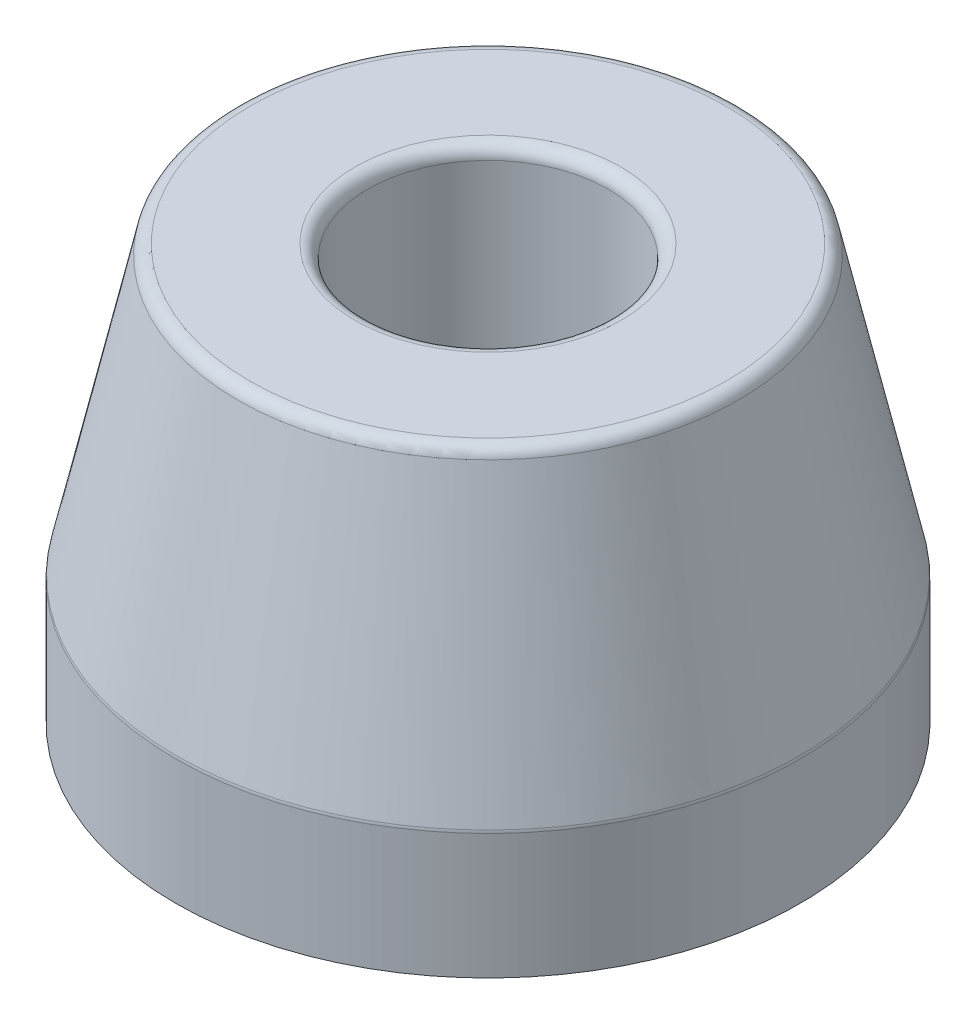
ISO-10303-21;
HEADER;
FILE_DESCRIPTION(('STEP AP214'),'2;1');
FILE_NAME('part.step','',(''),(''),'','','');
FILE_SCHEMA(('AUTOMOTIVE_DESIGN { 1 0 10303 214 1 1 1 1 }'));
ENDSEC;
DATA;
#1=APPLICATION_CONTEXT('core data for automotive mechanical design processes');
#2=APPLICATION_PROTOCOL_DEFINITION('international standard','automotive_design',2000,#1);
#3=PRODUCT_CONTEXT('',#1,'mechanical');
#4=PRODUCT('Part','Part','',(#3));
#5=PRODUCT_RELATED_PRODUCT_CATEGORY('part','',(#4));
#6=PRODUCT_DEFINITION_FORMATION('','',#4);
#7=PRODUCT_DEFINITION_CONTEXT('part definition',#1,'design');
#8=PRODUCT_DEFINITION('design','',#6,#7);
#9=PRODUCT_DEFINITION_SHAPE('','',#8);
#10=(LENGTH_UNIT() NAMED_UNIT(*) SI_UNIT(.MILLI.,.METRE.));
#11=(NAMED_UNIT(*) PLANE_ANGLE_UNIT() SI_UNIT($,.RADIAN.));
#12=(NAMED_UNIT(*) SI_UNIT($,.STERADIAN.) SOLID_ANGLE_UNIT());
#13=UNCERTAINTY_MEASURE_WITH_UNIT(LENGTH_MEASURE(1.E-05),#10,'distance_accuracy_value','');
#14=(GEOMETRIC_REPRESENTATION_CONTEXT(3) GLOBAL_UNCERTAINTY_ASSIGNED_CONTEXT((#13)) GLOBAL_UNIT_ASSIGNED_CONTEXT((#10,
#11,#12)) REPRESENTATION_CONTEXT('',''));
#15=CARTESIAN_POINT('',(0.,0.,0.));
#16=DIRECTION('',(0.,0.,1.));
#17=DIRECTION('',(1.,0.,0.));
#18=AXIS2_PLACEMENT_3D('',#15,#16,#17);
#19=CARTESIAN_POINT('',(12.3825,0.,0.));
#20=DIRECTION('',(0.,-1.,0.));
#21=DIRECTION('',(0.,0.,-1.));
#22=AXIS2_PLACEMENT_3D('',#19,#20,#21);
#23=PLANE('',#22);
#24=CARTESIAN_POINT('',(0.,0.,0.));
#25=DIRECTION('',(0.,-1.,0.));
#26=DIRECTION('',(0.,0.,-1.));
#27=AXIS2_PLACEMENT_3D('',#24,#25,#26);
#28=CIRCLE('',#27,12.3825);
#29=CARTESIAN_POINT('',(0.,0.,-12.3825));
#30=VERTEX_POINT('',#29);
#31=EDGE_CURVE('E59',#30,#30,#28,.T.);
#32=ORIENTED_EDGE('',*,*,#31,.T.);
#33=EDGE_LOOP('',(#32));
#34=FACE_BOUND('',#33,.T.);
#35=CARTESIAN_POINT('',(0.,0.,0.));
#36=DIRECTION('',(0.,-1.,0.));
#37=DIRECTION('',(0.,0.,-1.));
#38=AXIS2_PLACEMENT_3D('',#35,#36,#37);
#39=CIRCLE('',#38,4.7625);
#40=CARTESIAN_POINT('',(0.,0.,-4.7625));
#41=VERTEX_POINT('',#40);
#42=EDGE_CURVE('E10',#41,#41,#39,.T.);
#43=ORIENTED_EDGE('',*,*,#42,.F.);
#44=EDGE_LOOP('',(#43));
#45=FACE_BOUND('',#44,.T.);
#46=ADVANCED_FACE('F31',(#34,#45),#23,.T.);
#47=CARTESIAN_POINT('',(0.,0.,0.));
#48=DIRECTION('',(0.,-1.,0.));
#49=DIRECTION('',(0.,0.,-1.));
#50=AXIS2_PLACEMENT_3D('',#47,#48,#49);
#51=CYLINDRICAL_SURFACE('',#50,4.7625);
#52=ORIENTED_EDGE('',*,*,#42,.T.);
#53=EDGE_LOOP('',(#52));
#54=FACE_BOUND('',#53,.T.);
#55=CARTESIAN_POINT('',(0.,15.937,0.));
#56=DIRECTION('',(0.,-1.,0.));
#57=DIRECTION('',(0.,0.,-1.));
#58=AXIS2_PLACEMENT_3D('',#55,#56,#57);
#59=CIRCLE('',#58,4.7625);
#60=CARTESIAN_POINT('',(0.,15.937,-4.7625));
#61=VERTEX_POINT('',#60);
#62=EDGE_CURVE('E37',#61,#61,#59,.T.);
#63=ORIENTED_EDGE('',*,*,#62,.F.);
#64=EDGE_LOOP('',(#63));
#65=FACE_BOUND('',#64,.T.);
#66=ADVANCED_FACE('F77',(#54,#65),#51,.F.);
#67=CARTESIAN_POINT('',(0.,15.937,0.));
#68=DIRECTION('',(0.,-1.,0.));
#69=DIRECTION('',(0.,0.,-1.));
#70=AXIS2_PLACEMENT_3D('',#67,#68,#69);
#71=TOROIDAL_SURFACE('',#70,5.2705,0.508);
#72=ORIENTED_EDGE('',*,*,#62,.T.);
#73=EDGE_LOOP('',(#72));
#74=FACE_BOUND('',#73,.T.);
#75=CARTESIAN_POINT('',(0.,16.445,0.));
#76=DIRECTION('',(0.,-1.,0.));
#77=DIRECTION('',(0.,0.,-1.));
#78=AXIS2_PLACEMENT_3D('',#75,#76,#77);
#79=CIRCLE('',#78,5.2705);
#80=CARTESIAN_POINT('',(0.,16.445,-5.2705));
#81=VERTEX_POINT('',#80);
#82=EDGE_CURVE('E41',#81,#81,#79,.T.);
#83=ORIENTED_EDGE('',*,*,#82,.F.);
#84=EDGE_LOOP('',(#83));
#85=FACE_BOUND('',#84,.T.);
#86=ADVANCED_FACE('F81',(#74,#85),#71,.T.);
#87=CARTESIAN_POINT('',(5.2705,16.445,0.));
#88=DIRECTION('',(0.,1.,0.));
#89=DIRECTION('',(0.,0.,1.));
#90=AXIS2_PLACEMENT_3D('',#87,#88,#89);
#91=PLANE('',#90);
#92=ORIENTED_EDGE('',*,*,#82,.T.);
#93=EDGE_LOOP('',(#92));
#94=FACE_BOUND('',#93,.T.);
#95=CARTESIAN_POINT('',(0.,16.445,0.));
#96=DIRECTION('',(0.,-1.,0.));
#97=DIRECTION('',(0.,0.,-1.));
#98=AXIS2_PLACEMENT_3D('',#95,#96,#97);
#99=CIRCLE('',#98,9.43499682396614);
#100=CARTESIAN_POINT('',(0.,16.445,-9.43499682396614));
#101=VERTEX_POINT('',#100);
#102=EDGE_CURVE('E45',#101,#101,#99,.T.);
#103=ORIENTED_EDGE('',*,*,#102,.F.);
#104=EDGE_LOOP('',(#103));
#105=FACE_BOUND('',#104,.T.);
#106=ADVANCED_FACE('F85',(#94,#105),#91,.T.);
#107=CARTESIAN_POINT('',(0.,15.937,0.));
#108=DIRECTION('',(0.,-1.,0.));
#109=DIRECTION('',(0.,0.,-1.));
#110=AXIS2_PLACEMENT_3D('',#107,#108,#109);
#111=TOROIDAL_SURFACE('',#110,9.43499682396614,0.508);
#112=ORIENTED_EDGE('',*,*,#102,.T.);
#113=EDGE_LOOP('',(#112));
#114=FACE_BOUND('',#113,.T.);
#115=CARTESIAN_POINT('',(0.,16.0472006725719,0.));
#116=DIRECTION('',(0.,-1.,0.));
#117=DIRECTION('',(0.,0.,-1.));
#118=AXIS2_PLACEMENT_3D('',#115,#116,#117);
#119=CIRCLE('',#118,9.93089985053959);
#120=CARTESIAN_POINT('',(0.,16.0472006725719,-9.93089985053959));
#121=VERTEX_POINT('',#120);
#122=EDGE_CURVE('E50',#121,#121,#119,.T.);
#123=ORIENTED_EDGE('',*,*,#122,.F.);
#124=EDGE_LOOP('',(#123));
#125=FACE_BOUND('',#124,.T.);
#126=ADVANCED_FACE('F91',(#114,#125),#111,.T.);
#127=CARTESIAN_POINT('',(0.,5.06943638041948,0.));
#128=DIRECTION('',(0.,-1.,0.));
#129=DIRECTION('',(0.,0.,-1.));
#130=AXIS2_PLACEMENT_3D('',#127,#128,#129);
#131=CONICAL_SURFACE('',#130,12.3704030265734,0.218668945873942);
#132=ORIENTED_EDGE('',*,*,#122,.T.);
#133=EDGE_LOOP('',(#132));
#134=FACE_BOUND('',#133,.T.);
#135=CARTESIAN_POINT('',(0.,5.06943638041948,0.));
#136=DIRECTION('',(0.,-1.,0.));
#137=DIRECTION('',(0.,0.,-1.));
#138=AXIS2_PLACEMENT_3D('',#135,#136,#137);
#139=CIRCLE('',#138,12.3704030265734);
#140=CARTESIAN_POINT('',(0.,5.06943638041948,-12.3704030265734));
#141=VERTEX_POINT('',#140);
#142=EDGE_CURVE('E53',#141,#141,#139,.T.);
#143=ORIENTED_EDGE('',*,*,#142,.F.);
#144=EDGE_LOOP('',(#143));
#145=FACE_BOUND('',#144,.T.);
#146=ADVANCED_FACE('F73',(#134,#145),#131,.T.);
#147=CARTESIAN_POINT('',(0.,4.95923570784761,0.));
#148=DIRECTION('',(0.,-1.,0.));
#149=DIRECTION('',(0.,0.,-1.));
#150=AXIS2_PLACEMENT_3D('',#147,#148,#149);
#151=TOROIDAL_SURFACE('',#150,11.8745,0.507999999999999);
#152=ORIENTED_EDGE('',*,*,#142,.T.);
#153=EDGE_LOOP('',(#152));
#154=FACE_BOUND('',#153,.T.);
#155=CARTESIAN_POINT('',(0.,4.95923570784761,0.));
#156=DIRECTION('',(0.,-1.,0.));
#157=DIRECTION('',(0.,0.,-1.));
#158=AXIS2_PLACEMENT_3D('',#155,#156,#157);
#159=CIRCLE('',#158,12.3825);
#160=CARTESIAN_POINT('',(0.,4.95923570784761,-12.3825));
#161=VERTEX_POINT('',#160);
#162=EDGE_CURVE('E56',#161,#161,#159,.T.);
#163=ORIENTED_EDGE('',*,*,#162,.F.);
#164=EDGE_LOOP('',(#163));
#165=FACE_BOUND('',#164,.T.);
#166=ADVANCED_FACE('F67',(#154,#165),#151,.T.);
#167=CARTESIAN_POINT('',(0.,0.,0.));
#168=DIRECTION('',(0.,-1.,0.));
#169=DIRECTION('',(0.,0.,-1.));
#170=AXIS2_PLACEMENT_3D('',#167,#168,#169);
#171=CYLINDRICAL_SURFACE('',#170,12.3825);
#172=ORIENTED_EDGE('',*,*,#162,.T.);
#173=EDGE_LOOP('',(#172));
#174=FACE_BOUND('',#173,.T.);
#175=ORIENTED_EDGE('',*,*,#31,.F.);
#176=EDGE_LOOP('',(#175));
#177=FACE_BOUND('',#176,.T.);
#178=ADVANCED_FACE('F65',(#174,#177),#171,.T.);
#179=CLOSED_SHELL('',(#46,#66,#86,#106,#126,#146,#166,#178));
#180=MANIFOLD_SOLID_BREP('B2',#179);
#181=ADVANCED_BREP_SHAPE_REPRESENTATION('',(#18,#180),#14);
#182=SHAPE_DEFINITION_REPRESENTATION(#9,#181);
ENDSEC;
END-ISO-10303-21;
